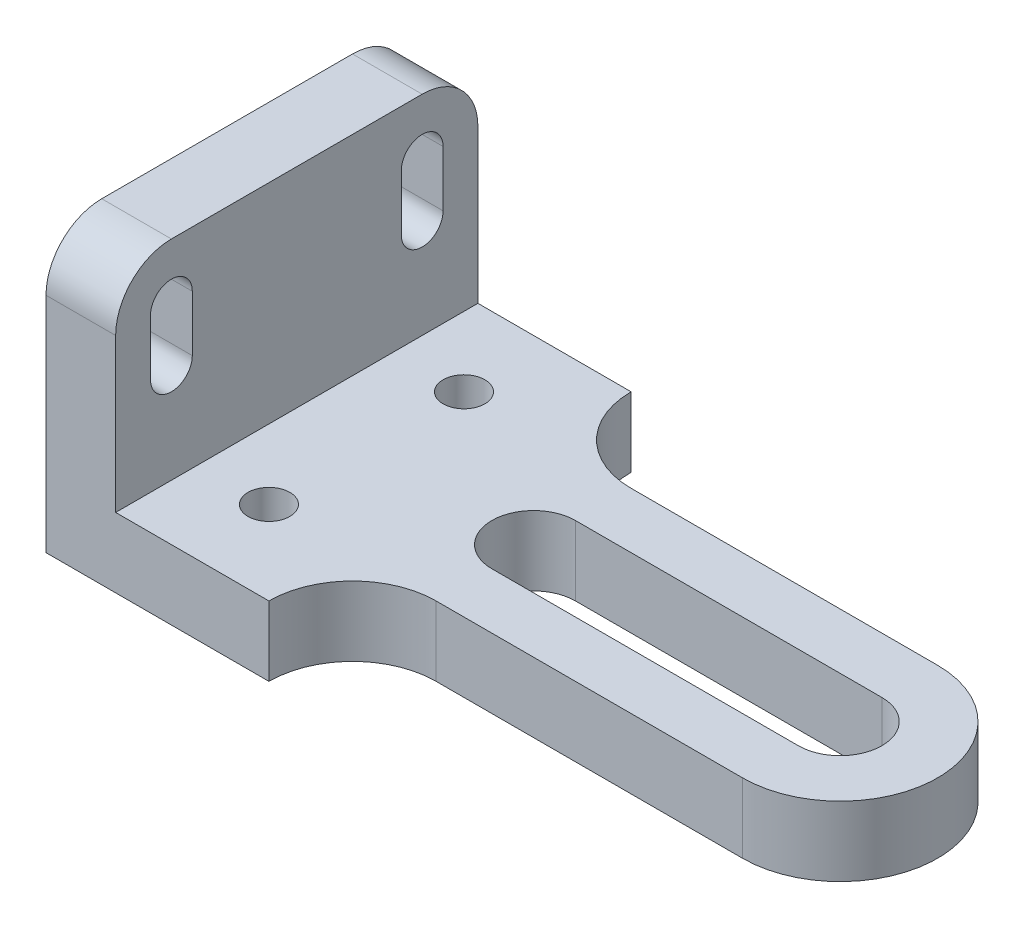
ISO-10303-21;
HEADER;
FILE_DESCRIPTION(('STEP AP214'),'2;1');
FILE_NAME('part.step','',(''),(''),'','','');
FILE_SCHEMA(('AUTOMOTIVE_DESIGN { 1 0 10303 214 1 1 1 1 }'));
ENDSEC;
DATA;
#1=APPLICATION_CONTEXT('core data for automotive mechanical design processes');
#2=APPLICATION_PROTOCOL_DEFINITION('international standard','automotive_design',2000,#1);
#3=PRODUCT_CONTEXT('',#1,'mechanical');
#4=PRODUCT('Part','Part','',(#3));
#5=PRODUCT_RELATED_PRODUCT_CATEGORY('part','',(#4));
#6=PRODUCT_DEFINITION_FORMATION('','',#4);
#7=PRODUCT_DEFINITION_CONTEXT('part definition',#1,'design');
#8=PRODUCT_DEFINITION('design','',#6,#7);
#9=PRODUCT_DEFINITION_SHAPE('','',#8);
#10=(LENGTH_UNIT() NAMED_UNIT(*) SI_UNIT(.MILLI.,.METRE.));
#11=(NAMED_UNIT(*) PLANE_ANGLE_UNIT() SI_UNIT($,.RADIAN.));
#12=(NAMED_UNIT(*) SI_UNIT($,.STERADIAN.) SOLID_ANGLE_UNIT());
#13=UNCERTAINTY_MEASURE_WITH_UNIT(LENGTH_MEASURE(1.E-05),#10,'distance_accuracy_value','');
#14=(GEOMETRIC_REPRESENTATION_CONTEXT(3) GLOBAL_UNCERTAINTY_ASSIGNED_CONTEXT((#13)) GLOBAL_UNIT_ASSIGNED_CONTEXT((#10,
#11,#12)) REPRESENTATION_CONTEXT('',''));
#15=CARTESIAN_POINT('',(0.,0.,0.));
#16=DIRECTION('',(0.,0.,1.));
#17=DIRECTION('',(1.,0.,0.));
#18=AXIS2_PLACEMENT_3D('',#15,#16,#17);
#19=CARTESIAN_POINT('',(10.,32.,-18.));
#20=DIRECTION('',(1.,0.,0.));
#21=DIRECTION('',(0.,0.,-1.));
#22=AXIS2_PLACEMENT_3D('',#19,#20,#21);
#23=PLANE('',#22);
#24=DIRECTION('',(0.,-1.,0.));
#25=VECTOR('',#24,1.);
#26=CARTESIAN_POINT('',(10.,32.,21.));
#27=LINE('',#26,#25);
#28=CARTESIAN_POINT('',(10.,32.,21.));
#29=VERTEX_POINT('',#28);
#30=CARTESIAN_POINT('',(10.,24.,21.));
#31=VERTEX_POINT('',#30);
#32=EDGE_CURVE('E321',#29,#31,#27,.T.);
#33=ORIENTED_EDGE('',*,*,#32,.F.);
#34=CARTESIAN_POINT('',(10.,32.,18.));
#35=DIRECTION('',(1.,0.,0.));
#36=DIRECTION('',(0.,0.,-1.));
#37=AXIS2_PLACEMENT_3D('',#34,#35,#36);
#38=CIRCLE('',#37,2.99999999999999);
#39=CARTESIAN_POINT('',(10.,32.,15.));
#40=VERTEX_POINT('',#39);
#41=EDGE_CURVE('E319',#40,#29,#38,.T.);
#42=ORIENTED_EDGE('',*,*,#41,.F.);
#43=DIRECTION('',(0.,1.,0.));
#44=VECTOR('',#43,1.);
#45=CARTESIAN_POINT('',(10.,32.,15.));
#46=LINE('',#45,#44);
#47=CARTESIAN_POINT('',(10.,24.,15.));
#48=VERTEX_POINT('',#47);
#49=EDGE_CURVE('E327',#48,#40,#46,.T.);
#50=ORIENTED_EDGE('',*,*,#49,.F.);
#51=CARTESIAN_POINT('',(10.,24.,18.));
#52=DIRECTION('',(1.,0.,0.));
#53=DIRECTION('',(0.,0.,-1.));
#54=AXIS2_PLACEMENT_3D('',#51,#52,#53);
#55=CIRCLE('',#54,3.00000000000001);
#56=EDGE_CURVE('E324',#31,#48,#55,.T.);
#57=ORIENTED_EDGE('',*,*,#56,.F.);
#58=EDGE_LOOP('',(#33,#42,#50,#57));
#59=FACE_BOUND('',#58,.T.);
#60=DIRECTION('',(0.,-1.,0.));
#61=VECTOR('',#60,1.);
#62=CARTESIAN_POINT('',(10.,32.,-15.));
#63=LINE('',#62,#61);
#64=CARTESIAN_POINT('',(10.,32.,-15.));
#65=VERTEX_POINT('',#64);
#66=CARTESIAN_POINT('',(10.,24.,-15.));
#67=VERTEX_POINT('',#66);
#68=EDGE_CURVE('E292',#65,#67,#63,.T.);
#69=ORIENTED_EDGE('',*,*,#68,.F.);
#70=CARTESIAN_POINT('',(10.,32.,-18.));
#71=DIRECTION('',(1.,0.,0.));
#72=DIRECTION('',(0.,0.,1.));
#73=AXIS2_PLACEMENT_3D('',#70,#71,#72);
#74=CIRCLE('',#73,2.99999999999999);
#75=CARTESIAN_POINT('',(10.,32.,-21.));
#76=VERTEX_POINT('',#75);
#77=EDGE_CURVE('E290',#76,#65,#74,.T.);
#78=ORIENTED_EDGE('',*,*,#77,.F.);
#79=DIRECTION('',(0.,1.,0.));
#80=VECTOR('',#79,1.);
#81=CARTESIAN_POINT('',(10.,32.,-21.));
#82=LINE('',#81,#80);
#83=CARTESIAN_POINT('',(10.,24.,-21.));
#84=VERTEX_POINT('',#83);
#85=EDGE_CURVE('E297',#84,#76,#82,.T.);
#86=ORIENTED_EDGE('',*,*,#85,.F.);
#87=CARTESIAN_POINT('',(10.,24.,-18.));
#88=DIRECTION('',(1.,0.,0.));
#89=DIRECTION('',(0.,0.,1.));
#90=AXIS2_PLACEMENT_3D('',#87,#88,#89);
#91=CIRCLE('',#90,3.00000000000001);
#92=EDGE_CURVE('E295',#67,#84,#91,.T.);
#93=ORIENTED_EDGE('',*,*,#92,.F.);
#94=EDGE_LOOP('',(#69,#78,#86,#93));
#95=FACE_BOUND('',#94,.T.);
#96=DIRECTION('',(0.,-1.,0.));
#97=VECTOR('',#96,1.);
#98=CARTESIAN_POINT('',(10.,31.9999999999999,26.));
#99=LINE('',#98,#97);
#100=CARTESIAN_POINT('',(10.,31.9999999999999,26.));
#101=VERTEX_POINT('',#100);
#102=CARTESIAN_POINT('',(10.,10.,26.));
#103=VERTEX_POINT('',#102);
#104=EDGE_CURVE('E51',#101,#103,#99,.T.);
#105=ORIENTED_EDGE('',*,*,#104,.T.);
#106=DIRECTION('',(0.,0.,-1.));
#107=VECTOR('',#106,1.);
#108=CARTESIAN_POINT('',(10.,10.,-18.));
#109=LINE('',#108,#107);
#110=CARTESIAN_POINT('',(10.,10.,-26.));
#111=VERTEX_POINT('',#110);
#112=EDGE_CURVE('E287',#103,#111,#109,.T.);
#113=ORIENTED_EDGE('',*,*,#112,.T.);
#114=DIRECTION('',(0.,1.,0.));
#115=VECTOR('',#114,1.);
#116=CARTESIAN_POINT('',(10.,0.,-26.));
#117=LINE('',#116,#115);
#118=CARTESIAN_POINT('',(10.,32.,-26.));
#119=VERTEX_POINT('',#118);
#120=EDGE_CURVE('E351',#111,#119,#117,.T.);
#121=ORIENTED_EDGE('',*,*,#120,.T.);
#122=CARTESIAN_POINT('',(10.,32.,-18.));
#123=DIRECTION('',(1.,0.,0.));
#124=DIRECTION('',(0.,0.,-1.));
#125=AXIS2_PLACEMENT_3D('',#122,#123,#124);
#126=CIRCLE('',#125,8.);
#127=CARTESIAN_POINT('',(10.,40.,-17.9999999999999));
#128=VERTEX_POINT('',#127);
#129=EDGE_CURVE('E354',#119,#128,#126,.T.);
#130=ORIENTED_EDGE('',*,*,#129,.T.);
#131=DIRECTION('',(0.,0.,1.));
#132=VECTOR('',#131,1.);
#133=CARTESIAN_POINT('',(10.,40.,-17.9999999999999));
#134=LINE('',#133,#132);
#135=CARTESIAN_POINT('',(10.,40.,17.9999999999999));
#136=VERTEX_POINT('',#135);
#137=EDGE_CURVE('E356',#128,#136,#134,.T.);
#138=ORIENTED_EDGE('',*,*,#137,.T.);
#139=CARTESIAN_POINT('',(10.,32.,18.));
#140=DIRECTION('',(1.,0.,0.));
#141=DIRECTION('',(0.,0.,-1.));
#142=AXIS2_PLACEMENT_3D('',#139,#140,#141);
#143=CIRCLE('',#142,8.);
#144=EDGE_CURVE('E358',#136,#101,#143,.T.);
#145=ORIENTED_EDGE('',*,*,#144,.T.);
#146=EDGE_LOOP('',(#105,#113,#121,#130,#138,#145));
#147=FACE_BOUND('',#146,.T.);
#148=ADVANCED_FACE('F36',(#59,#95,#147),#23,.T.);
#149=CARTESIAN_POINT('',(0.,32.,-18.));
#150=DIRECTION('',(1.,0.,0.));
#151=DIRECTION('',(0.,0.,-1.));
#152=AXIS2_PLACEMENT_3D('',#149,#150,#151);
#153=PLANE('',#152);
#154=DIRECTION('',(0.,0.,-1.));
#155=VECTOR('',#154,1.);
#156=CARTESIAN_POINT('',(0.,0.,26.));
#157=LINE('',#156,#155);
#158=CARTESIAN_POINT('',(0.,0.,26.));
#159=VERTEX_POINT('',#158);
#160=CARTESIAN_POINT('',(0.,0.,-26.));
#161=VERTEX_POINT('',#160);
#162=EDGE_CURVE('E362',#159,#161,#157,.T.);
#163=ORIENTED_EDGE('',*,*,#162,.F.);
#164=DIRECTION('',(0.,-1.,0.));
#165=VECTOR('',#164,1.);
#166=CARTESIAN_POINT('',(0.,31.9999999999999,26.));
#167=LINE('',#166,#165);
#168=CARTESIAN_POINT('',(0.,31.9999999999999,26.));
#169=VERTEX_POINT('',#168);
#170=EDGE_CURVE('E349',#169,#159,#167,.T.);
#171=ORIENTED_EDGE('',*,*,#170,.F.);
#172=CARTESIAN_POINT('',(0.,32.,18.));
#173=DIRECTION('',(1.,0.,0.));
#174=DIRECTION('',(0.,0.,-1.));
#175=AXIS2_PLACEMENT_3D('',#172,#173,#174);
#176=CIRCLE('',#175,8.);
#177=CARTESIAN_POINT('',(0.,40.,17.9999999999999));
#178=VERTEX_POINT('',#177);
#179=EDGE_CURVE('E352',#178,#169,#176,.T.);
#180=ORIENTED_EDGE('',*,*,#179,.F.);
#181=DIRECTION('',(0.,0.,1.));
#182=VECTOR('',#181,1.);
#183=CARTESIAN_POINT('',(0.,40.,-17.9999999999999));
#184=LINE('',#183,#182);
#185=CARTESIAN_POINT('',(0.,40.,-17.9999999999999));
#186=VERTEX_POINT('',#185);
#187=EDGE_CURVE('E368',#186,#178,#184,.T.);
#188=ORIENTED_EDGE('',*,*,#187,.F.);
#189=CARTESIAN_POINT('',(0.,32.,-18.));
#190=DIRECTION('',(1.,0.,0.));
#191=DIRECTION('',(0.,0.,-1.));
#192=AXIS2_PLACEMENT_3D('',#189,#190,#191);
#193=CIRCLE('',#192,8.);
#194=CARTESIAN_POINT('',(0.,32.,-26.));
#195=VERTEX_POINT('',#194);
#196=EDGE_CURVE('E366',#195,#186,#193,.T.);
#197=ORIENTED_EDGE('',*,*,#196,.F.);
#198=DIRECTION('',(0.,1.,0.));
#199=VECTOR('',#198,1.);
#200=CARTESIAN_POINT('',(0.,0.,-26.));
#201=LINE('',#200,#199);
#202=EDGE_CURVE('E364',#161,#195,#201,.T.);
#203=ORIENTED_EDGE('',*,*,#202,.F.);
#204=EDGE_LOOP('',(#163,#171,#180,#188,#197,#203));
#205=FACE_BOUND('',#204,.T.);
#206=CARTESIAN_POINT('',(0.,32.,-18.));
#207=DIRECTION('',(1.,0.,0.));
#208=DIRECTION('',(0.,0.,1.));
#209=AXIS2_PLACEMENT_3D('',#206,#207,#208);
#210=CIRCLE('',#209,2.99999999999999);
#211=CARTESIAN_POINT('',(0.,32.,-21.));
#212=VERTEX_POINT('',#211);
#213=CARTESIAN_POINT('',(0.,32.,-15.));
#214=VERTEX_POINT('',#213);
#215=EDGE_CURVE('E289',#212,#214,#210,.T.);
#216=ORIENTED_EDGE('',*,*,#215,.T.);
#217=DIRECTION('',(0.,-1.,0.));
#218=VECTOR('',#217,1.);
#219=CARTESIAN_POINT('',(0.,32.,-15.));
#220=LINE('',#219,#218);
#221=CARTESIAN_POINT('',(0.,24.,-15.));
#222=VERTEX_POINT('',#221);
#223=EDGE_CURVE('E302',#214,#222,#220,.T.);
#224=ORIENTED_EDGE('',*,*,#223,.T.);
#225=CARTESIAN_POINT('',(0.,24.,-18.));
#226=DIRECTION('',(1.,0.,0.));
#227=DIRECTION('',(0.,0.,1.));
#228=AXIS2_PLACEMENT_3D('',#225,#226,#227);
#229=CIRCLE('',#228,3.00000000000001);
#230=CARTESIAN_POINT('',(0.,24.,-21.));
#231=VERTEX_POINT('',#230);
#232=EDGE_CURVE('E305',#222,#231,#229,.T.);
#233=ORIENTED_EDGE('',*,*,#232,.T.);
#234=DIRECTION('',(0.,1.,0.));
#235=VECTOR('',#234,1.);
#236=CARTESIAN_POINT('',(0.,32.,-21.));
#237=LINE('',#236,#235);
#238=EDGE_CURVE('E293',#231,#212,#237,.T.);
#239=ORIENTED_EDGE('',*,*,#238,.T.);
#240=EDGE_LOOP('',(#216,#224,#233,#239));
#241=FACE_BOUND('',#240,.T.);
#242=CARTESIAN_POINT('',(0.,32.,18.));
#243=DIRECTION('',(1.,0.,0.));
#244=DIRECTION('',(0.,0.,-1.));
#245=AXIS2_PLACEMENT_3D('',#242,#243,#244);
#246=CIRCLE('',#245,2.99999999999999);
#247=CARTESIAN_POINT('',(0.,32.,15.));
#248=VERTEX_POINT('',#247);
#249=CARTESIAN_POINT('',(0.,32.,21.));
#250=VERTEX_POINT('',#249);
#251=EDGE_CURVE('E318',#248,#250,#246,.T.);
#252=ORIENTED_EDGE('',*,*,#251,.T.);
#253=DIRECTION('',(0.,-1.,0.));
#254=VECTOR('',#253,1.);
#255=CARTESIAN_POINT('',(0.,32.,21.));
#256=LINE('',#255,#254);
#257=CARTESIAN_POINT('',(0.,24.,21.));
#258=VERTEX_POINT('',#257);
#259=EDGE_CURVE('E332',#250,#258,#256,.T.);
#260=ORIENTED_EDGE('',*,*,#259,.T.);
#261=CARTESIAN_POINT('',(0.,24.,18.));
#262=DIRECTION('',(1.,0.,0.));
#263=DIRECTION('',(0.,0.,-1.));
#264=AXIS2_PLACEMENT_3D('',#261,#262,#263);
#265=CIRCLE('',#264,3.00000000000001);
#266=CARTESIAN_POINT('',(0.,24.,15.));
#267=VERTEX_POINT('',#266);
#268=EDGE_CURVE('E335',#258,#267,#265,.T.);
#269=ORIENTED_EDGE('',*,*,#268,.T.);
#270=DIRECTION('',(0.,1.,0.));
#271=VECTOR('',#270,1.);
#272=CARTESIAN_POINT('',(0.,32.,15.));
#273=LINE('',#272,#271);
#274=EDGE_CURVE('E322',#267,#248,#273,.T.);
#275=ORIENTED_EDGE('',*,*,#274,.T.);
#276=EDGE_LOOP('',(#252,#260,#269,#275));
#277=FACE_BOUND('',#276,.T.);
#278=ADVANCED_FACE('F393',(#205,#241,#277),#153,.F.);
#279=CARTESIAN_POINT('',(10.,31.9999999999999,26.));
#280=DIRECTION('',(0.,0.,-1.));
#281=DIRECTION('',(0.,1.,0.));
#282=AXIS2_PLACEMENT_3D('',#279,#280,#281);
#283=PLANE('',#282);
#284=DIRECTION('',(-1.,0.,0.));
#285=VECTOR('',#284,1.);
#286=CARTESIAN_POINT('',(10.,0.,26.));
#287=LINE('',#286,#285);
#288=CARTESIAN_POINT('',(32.,0.,26.));
#289=VERTEX_POINT('',#288);
#290=EDGE_CURVE('E11',#289,#159,#287,.T.);
#291=ORIENTED_EDGE('',*,*,#290,.F.);
#292=DIRECTION('',(0.,-1.,0.));
#293=VECTOR('',#292,1.);
#294=CARTESIAN_POINT('',(32.,10.,26.));
#295=LINE('',#294,#293);
#296=CARTESIAN_POINT('',(32.,10.,26.));
#297=VERTEX_POINT('',#296);
#298=EDGE_CURVE('E284',#297,#289,#295,.T.);
#299=ORIENTED_EDGE('',*,*,#298,.F.);
#300=DIRECTION('',(1.,0.,0.));
#301=VECTOR('',#300,1.);
#302=CARTESIAN_POINT('',(0.,10.,26.));
#303=LINE('',#302,#301);
#304=EDGE_CURVE('E244',#103,#297,#303,.T.);
#305=ORIENTED_EDGE('',*,*,#304,.F.);
#306=ORIENTED_EDGE('',*,*,#104,.F.);
#307=DIRECTION('',(-1.,0.,0.));
#308=VECTOR('',#307,1.);
#309=CARTESIAN_POINT('',(10.,31.9999999999999,26.));
#310=LINE('',#309,#308);
#311=EDGE_CURVE('E360',#101,#169,#310,.T.);
#312=ORIENTED_EDGE('',*,*,#311,.T.);
#313=ORIENTED_EDGE('',*,*,#170,.T.);
#314=EDGE_LOOP('',(#291,#299,#305,#306,#312,#313));
#315=FACE_BOUND('',#314,.T.);
#316=ADVANCED_FACE('F38',(#315),#283,.F.);
#317=CARTESIAN_POINT('',(10.,0.,26.));
#318=DIRECTION('',(0.,1.,0.));
#319=DIRECTION('',(0.,0.,1.));
#320=AXIS2_PLACEMENT_3D('',#317,#318,#319);
#321=PLANE('',#320);
#322=ORIENTED_EDGE('',*,*,#162,.T.);
#323=DIRECTION('',(-1.,0.,0.));
#324=VECTOR('',#323,1.);
#325=CARTESIAN_POINT('',(10.,0.,-26.));
#326=LINE('',#325,#324);
#327=CARTESIAN_POINT('',(32.,0.,-26.));
#328=VERTEX_POINT('',#327);
#329=EDGE_CURVE('E44',#328,#161,#326,.T.);
#330=ORIENTED_EDGE('',*,*,#329,.F.);
#331=CARTESIAN_POINT('',(44.,0.,-26.));
#332=DIRECTION('',(0.,-1.,0.));
#333=DIRECTION('',(0.,0.,1.));
#334=AXIS2_PLACEMENT_3D('',#331,#332,#333);
#335=CIRCLE('',#334,12.);
#336=CARTESIAN_POINT('',(44.,0.,-14.));
#337=VERTEX_POINT('',#336);
#338=EDGE_CURVE('E247',#337,#328,#335,.T.);
#339=ORIENTED_EDGE('',*,*,#338,.F.);
#340=DIRECTION('',(-1.,0.,0.));
#341=VECTOR('',#340,1.);
#342=CARTESIAN_POINT('',(44.,0.,-14.));
#343=LINE('',#342,#341);
#344=CARTESIAN_POINT('',(88.,0.,-14.));
#345=VERTEX_POINT('',#344);
#346=EDGE_CURVE('E266',#345,#337,#343,.T.);
#347=ORIENTED_EDGE('',*,*,#346,.F.);
#348=CARTESIAN_POINT('',(88.,0.,0.));
#349=DIRECTION('',(0.,1.,0.));
#350=DIRECTION('',(0.,0.,-1.));
#351=AXIS2_PLACEMENT_3D('',#348,#349,#350);
#352=CIRCLE('',#351,14.);
#353=CARTESIAN_POINT('',(87.9999999999999,0.,14.));
#354=VERTEX_POINT('',#353);
#355=EDGE_CURVE('E264',#354,#345,#352,.T.);
#356=ORIENTED_EDGE('',*,*,#355,.F.);
#357=DIRECTION('',(1.,0.,0.));
#358=VECTOR('',#357,1.);
#359=CARTESIAN_POINT('',(44.,0.,14.));
#360=LINE('',#359,#358);
#361=CARTESIAN_POINT('',(44.,0.,14.));
#362=VERTEX_POINT('',#361);
#363=EDGE_CURVE('E262',#362,#354,#360,.T.);
#364=ORIENTED_EDGE('',*,*,#363,.F.);
#365=CARTESIAN_POINT('',(44.,0.,26.));
#366=DIRECTION('',(0.,-1.,0.));
#367=DIRECTION('',(0.,0.,-1.));
#368=AXIS2_PLACEMENT_3D('',#365,#366,#367);
#369=CIRCLE('',#368,12.);
#370=EDGE_CURVE('E217',#289,#362,#369,.T.);
#371=ORIENTED_EDGE('',*,*,#370,.F.);
#372=ORIENTED_EDGE('',*,*,#290,.T.);
#373=EDGE_LOOP('',(#322,#330,#339,#347,#356,#364,#371,#372));
#374=FACE_BOUND('',#373,.T.);
#375=CARTESIAN_POINT('',(20.,0.,14.));
#376=DIRECTION('',(0.,1.,0.));
#377=DIRECTION('',(0.,0.,1.));
#378=AXIS2_PLACEMENT_3D('',#375,#376,#377);
#379=CIRCLE('',#378,3.);
#380=CARTESIAN_POINT('',(20.,0.,17.));
#381=VERTEX_POINT('',#380);
#382=EDGE_CURVE('E528',#381,#381,#379,.T.);
#383=ORIENTED_EDGE('',*,*,#382,.T.);
#384=EDGE_LOOP('',(#383));
#385=FACE_BOUND('',#384,.T.);
#386=DIRECTION('',(-1.,0.,0.));
#387=VECTOR('',#386,1.);
#388=CARTESIAN_POINT('',(44.,0.,-6.));
#389=LINE('',#388,#387);
#390=CARTESIAN_POINT('',(88.,0.,-6.));
#391=VERTEX_POINT('',#390);
#392=CARTESIAN_POINT('',(44.,0.,-6.));
#393=VERTEX_POINT('',#392);
#394=EDGE_CURVE('E210',#391,#393,#389,.T.);
#395=ORIENTED_EDGE('',*,*,#394,.T.);
#396=CARTESIAN_POINT('',(44.,0.,0.));
#397=DIRECTION('',(0.,1.,0.));
#398=DIRECTION('',(0.,0.,1.));
#399=AXIS2_PLACEMENT_3D('',#396,#397,#398);
#400=CIRCLE('',#399,6.);
#401=CARTESIAN_POINT('',(44.,0.,6.));
#402=VERTEX_POINT('',#401);
#403=EDGE_CURVE('E231',#393,#402,#400,.T.);
#404=ORIENTED_EDGE('',*,*,#403,.T.);
#405=DIRECTION('',(1.,0.,0.));
#406=VECTOR('',#405,1.);
#407=CARTESIAN_POINT('',(44.,0.,6.));
#408=LINE('',#407,#406);
#409=CARTESIAN_POINT('',(88.,0.,6.));
#410=VERTEX_POINT('',#409);
#411=EDGE_CURVE('E216',#402,#410,#408,.T.);
#412=ORIENTED_EDGE('',*,*,#411,.T.);
#413=CARTESIAN_POINT('',(88.,0.,0.));
#414=DIRECTION('',(0.,1.,0.));
#415=DIRECTION('',(0.,0.,1.));
#416=AXIS2_PLACEMENT_3D('',#413,#414,#415);
#417=CIRCLE('',#416,6.);
#418=EDGE_CURVE('E235',#410,#391,#417,.T.);
#419=ORIENTED_EDGE('',*,*,#418,.T.);
#420=EDGE_LOOP('',(#395,#404,#412,#419));
#421=FACE_BOUND('',#420,.T.);
#422=CARTESIAN_POINT('',(20.,0.,-14.));
#423=DIRECTION('',(0.,1.,0.));
#424=DIRECTION('',(0.,0.,1.));
#425=AXIS2_PLACEMENT_3D('',#422,#423,#424);
#426=CIRCLE('',#425,3.);
#427=CARTESIAN_POINT('',(20.,0.,-11.));
#428=VERTEX_POINT('',#427);
#429=EDGE_CURVE('E525',#428,#428,#426,.T.);
#430=ORIENTED_EDGE('',*,*,#429,.T.);
#431=EDGE_LOOP('',(#430));
#432=FACE_BOUND('',#431,.T.);
#433=ADVANCED_FACE('F416',(#374,#385,#421,#432),#321,.F.);
#434=CARTESIAN_POINT('',(10.,0.,-26.));
#435=DIRECTION('',(0.,0.,1.));
#436=DIRECTION('',(0.,-1.,0.));
#437=AXIS2_PLACEMENT_3D('',#434,#435,#436);
#438=PLANE('',#437);
#439=ORIENTED_EDGE('',*,*,#202,.T.);
#440=DIRECTION('',(-1.,0.,0.));
#441=VECTOR('',#440,1.);
#442=CARTESIAN_POINT('',(10.,32.,-26.));
#443=LINE('',#442,#441);
#444=EDGE_CURVE('E379',#119,#195,#443,.T.);
#445=ORIENTED_EDGE('',*,*,#444,.F.);
#446=ORIENTED_EDGE('',*,*,#120,.F.);
#447=DIRECTION('',(-1.,0.,0.));
#448=VECTOR('',#447,1.);
#449=CARTESIAN_POINT('',(0.,10.,-26.));
#450=LINE('',#449,#448);
#451=CARTESIAN_POINT('',(32.,10.,-26.));
#452=VERTEX_POINT('',#451);
#453=EDGE_CURVE('E257',#452,#111,#450,.T.);
#454=ORIENTED_EDGE('',*,*,#453,.F.);
#455=DIRECTION('',(0.,-1.,0.));
#456=VECTOR('',#455,1.);
#457=CARTESIAN_POINT('',(32.,10.,-26.));
#458=LINE('',#457,#456);
#459=EDGE_CURVE('E260',#452,#328,#458,.T.);
#460=ORIENTED_EDGE('',*,*,#459,.T.);
#461=ORIENTED_EDGE('',*,*,#329,.T.);
#462=EDGE_LOOP('',(#439,#445,#446,#454,#460,#461));
#463=FACE_BOUND('',#462,.T.);
#464=ADVANCED_FACE('F384',(#463),#438,.F.);
#465=CARTESIAN_POINT('',(10.,32.,-18.));
#466=DIRECTION('',(-1.,0.,0.));
#467=DIRECTION('',(0.,0.,1.));
#468=AXIS2_PLACEMENT_3D('',#465,#466,#467);
#469=CYLINDRICAL_SURFACE('',#468,8.);
#470=ORIENTED_EDGE('',*,*,#196,.T.);
#471=DIRECTION('',(-1.,0.,0.));
#472=VECTOR('',#471,1.);
#473=CARTESIAN_POINT('',(10.,40.,-17.9999999999999));
#474=LINE('',#473,#472);
#475=EDGE_CURVE('E376',#128,#186,#474,.T.);
#476=ORIENTED_EDGE('',*,*,#475,.F.);
#477=ORIENTED_EDGE('',*,*,#129,.F.);
#478=ORIENTED_EDGE('',*,*,#444,.T.);
#479=EDGE_LOOP('',(#470,#476,#477,#478));
#480=FACE_BOUND('',#479,.T.);
#481=ADVANCED_FACE('F400',(#480),#469,.T.);
#482=CARTESIAN_POINT('',(10.,40.,-17.9999999999999));
#483=DIRECTION('',(0.,-1.,0.));
#484=DIRECTION('',(0.,0.,-1.));
#485=AXIS2_PLACEMENT_3D('',#482,#483,#484);
#486=PLANE('',#485);
#487=ORIENTED_EDGE('',*,*,#187,.T.);
#488=DIRECTION('',(-1.,0.,0.));
#489=VECTOR('',#488,1.);
#490=CARTESIAN_POINT('',(10.,40.,17.9999999999999));
#491=LINE('',#490,#489);
#492=EDGE_CURVE('E373',#136,#178,#491,.T.);
#493=ORIENTED_EDGE('',*,*,#492,.F.);
#494=ORIENTED_EDGE('',*,*,#137,.F.);
#495=ORIENTED_EDGE('',*,*,#475,.T.);
#496=EDGE_LOOP('',(#487,#493,#494,#495));
#497=FACE_BOUND('',#496,.T.);
#498=ADVANCED_FACE('F404',(#497),#486,.F.);
#499=CARTESIAN_POINT('',(10.,32.,18.));
#500=DIRECTION('',(-1.,0.,0.));
#501=DIRECTION('',(0.,0.,1.));
#502=AXIS2_PLACEMENT_3D('',#499,#500,#501);
#503=CYLINDRICAL_SURFACE('',#502,8.);
#504=ORIENTED_EDGE('',*,*,#179,.T.);
#505=ORIENTED_EDGE('',*,*,#311,.F.);
#506=ORIENTED_EDGE('',*,*,#144,.F.);
#507=ORIENTED_EDGE('',*,*,#492,.T.);
#508=EDGE_LOOP('',(#504,#505,#506,#507));
#509=FACE_BOUND('',#508,.T.);
#510=ADVANCED_FACE('F438',(#509),#503,.T.);
#511=CARTESIAN_POINT('',(10.,32.,18.));
#512=DIRECTION('',(-1.,0.,0.));
#513=DIRECTION('',(0.,0.,1.));
#514=AXIS2_PLACEMENT_3D('',#511,#512,#513);
#515=CYLINDRICAL_SURFACE('',#514,2.99999999999999);
#516=ORIENTED_EDGE('',*,*,#251,.F.);
#517=DIRECTION('',(-1.,0.,0.));
#518=VECTOR('',#517,1.);
#519=CARTESIAN_POINT('',(10.,32.,15.));
#520=LINE('',#519,#518);
#521=EDGE_CURVE('E329',#40,#248,#520,.T.);
#522=ORIENTED_EDGE('',*,*,#521,.F.);
#523=ORIENTED_EDGE('',*,*,#41,.T.);
#524=DIRECTION('',(-1.,0.,0.));
#525=VECTOR('',#524,1.);
#526=CARTESIAN_POINT('',(10.,32.,21.));
#527=LINE('',#526,#525);
#528=EDGE_CURVE('E346',#29,#250,#527,.T.);
#529=ORIENTED_EDGE('',*,*,#528,.T.);
#530=EDGE_LOOP('',(#516,#522,#523,#529));
#531=FACE_BOUND('',#530,.T.);
#532=ADVANCED_FACE('F440',(#531),#515,.F.);
#533=CARTESIAN_POINT('',(10.,32.,21.));
#534=DIRECTION('',(0.,0.,-1.));
#535=DIRECTION('',(0.,1.,0.));
#536=AXIS2_PLACEMENT_3D('',#533,#534,#535);
#537=PLANE('',#536);
#538=ORIENTED_EDGE('',*,*,#259,.F.);
#539=ORIENTED_EDGE('',*,*,#528,.F.);
#540=ORIENTED_EDGE('',*,*,#32,.T.);
#541=DIRECTION('',(-1.,0.,0.));
#542=VECTOR('',#541,1.);
#543=CARTESIAN_POINT('',(10.,24.,21.));
#544=LINE('',#543,#542);
#545=EDGE_CURVE('E344',#31,#258,#544,.T.);
#546=ORIENTED_EDGE('',*,*,#545,.T.);
#547=EDGE_LOOP('',(#538,#539,#540,#546));
#548=FACE_BOUND('',#547,.T.);
#549=ADVANCED_FACE('F446',(#548),#537,.T.);
#550=CARTESIAN_POINT('',(10.,24.,18.));
#551=DIRECTION('',(-1.,0.,0.));
#552=DIRECTION('',(0.,0.,1.));
#553=AXIS2_PLACEMENT_3D('',#550,#551,#552);
#554=CYLINDRICAL_SURFACE('',#553,3.00000000000001);
#555=ORIENTED_EDGE('',*,*,#268,.F.);
#556=ORIENTED_EDGE('',*,*,#545,.F.);
#557=ORIENTED_EDGE('',*,*,#56,.T.);
#558=DIRECTION('',(-1.,0.,0.));
#559=VECTOR('',#558,1.);
#560=CARTESIAN_POINT('',(10.,24.,15.));
#561=LINE('',#560,#559);
#562=EDGE_CURVE('E342',#48,#267,#561,.T.);
#563=ORIENTED_EDGE('',*,*,#562,.T.);
#564=EDGE_LOOP('',(#555,#556,#557,#563));
#565=FACE_BOUND('',#564,.T.);
#566=ADVANCED_FACE('F462',(#565),#554,.F.);
#567=CARTESIAN_POINT('',(10.,32.,15.));
#568=DIRECTION('',(0.,0.,1.));
#569=DIRECTION('',(0.,-1.,0.));
#570=AXIS2_PLACEMENT_3D('',#567,#568,#569);
#571=PLANE('',#570);
#572=ORIENTED_EDGE('',*,*,#274,.F.);
#573=ORIENTED_EDGE('',*,*,#562,.F.);
#574=ORIENTED_EDGE('',*,*,#49,.T.);
#575=ORIENTED_EDGE('',*,*,#521,.T.);
#576=EDGE_LOOP('',(#572,#573,#574,#575));
#577=FACE_BOUND('',#576,.T.);
#578=ADVANCED_FACE('F466',(#577),#571,.T.);
#579=CARTESIAN_POINT('',(10.,32.,-18.));
#580=DIRECTION('',(-1.,0.,0.));
#581=DIRECTION('',(0.,0.,1.));
#582=AXIS2_PLACEMENT_3D('',#579,#580,#581);
#583=CYLINDRICAL_SURFACE('',#582,2.99999999999999);
#584=ORIENTED_EDGE('',*,*,#215,.F.);
#585=DIRECTION('',(-1.,0.,0.));
#586=VECTOR('',#585,1.);
#587=CARTESIAN_POINT('',(10.,32.,-21.));
#588=LINE('',#587,#586);
#589=EDGE_CURVE('E299',#76,#212,#588,.T.);
#590=ORIENTED_EDGE('',*,*,#589,.F.);
#591=ORIENTED_EDGE('',*,*,#77,.T.);
#592=DIRECTION('',(-1.,0.,0.));
#593=VECTOR('',#592,1.);
#594=CARTESIAN_POINT('',(10.,32.,-15.));
#595=LINE('',#594,#593);
#596=EDGE_CURVE('E315',#65,#214,#595,.T.);
#597=ORIENTED_EDGE('',*,*,#596,.T.);
#598=EDGE_LOOP('',(#584,#590,#591,#597));
#599=FACE_BOUND('',#598,.T.);
#600=ADVANCED_FACE('F470',(#599),#583,.F.);
#601=CARTESIAN_POINT('',(10.,32.,-15.));
#602=DIRECTION('',(0.,0.,-1.));
#603=DIRECTION('',(0.,1.,0.));
#604=AXIS2_PLACEMENT_3D('',#601,#602,#603);
#605=PLANE('',#604);
#606=ORIENTED_EDGE('',*,*,#223,.F.);
#607=ORIENTED_EDGE('',*,*,#596,.F.);
#608=ORIENTED_EDGE('',*,*,#68,.T.);
#609=DIRECTION('',(-1.,0.,0.));
#610=VECTOR('',#609,1.);
#611=CARTESIAN_POINT('',(10.,24.,-15.));
#612=LINE('',#611,#610);
#613=EDGE_CURVE('E313',#67,#222,#612,.T.);
#614=ORIENTED_EDGE('',*,*,#613,.T.);
#615=EDGE_LOOP('',(#606,#607,#608,#614));
#616=FACE_BOUND('',#615,.T.);
#617=ADVANCED_FACE('F474',(#616),#605,.T.);
#618=CARTESIAN_POINT('',(10.,24.,-18.));
#619=DIRECTION('',(-1.,0.,0.));
#620=DIRECTION('',(0.,0.,1.));
#621=AXIS2_PLACEMENT_3D('',#618,#619,#620);
#622=CYLINDRICAL_SURFACE('',#621,3.00000000000001);
#623=ORIENTED_EDGE('',*,*,#232,.F.);
#624=ORIENTED_EDGE('',*,*,#613,.F.);
#625=ORIENTED_EDGE('',*,*,#92,.T.);
#626=DIRECTION('',(-1.,0.,0.));
#627=VECTOR('',#626,1.);
#628=CARTESIAN_POINT('',(10.,24.,-21.));
#629=LINE('',#628,#627);
#630=EDGE_CURVE('E59',#84,#231,#629,.T.);
#631=ORIENTED_EDGE('',*,*,#630,.T.);
#632=EDGE_LOOP('',(#623,#624,#625,#631));
#633=FACE_BOUND('',#632,.T.);
#634=ADVANCED_FACE('F478',(#633),#622,.F.);
#635=CARTESIAN_POINT('',(10.,32.,-21.));
#636=DIRECTION('',(0.,0.,1.));
#637=DIRECTION('',(0.,-1.,0.));
#638=AXIS2_PLACEMENT_3D('',#635,#636,#637);
#639=PLANE('',#638);
#640=ORIENTED_EDGE('',*,*,#238,.F.);
#641=ORIENTED_EDGE('',*,*,#630,.F.);
#642=ORIENTED_EDGE('',*,*,#85,.T.);
#643=ORIENTED_EDGE('',*,*,#589,.T.);
#644=EDGE_LOOP('',(#640,#641,#642,#643));
#645=FACE_BOUND('',#644,.T.);
#646=ADVANCED_FACE('F482',(#645),#639,.T.);
#647=CARTESIAN_POINT('',(44.,10.,26.));
#648=DIRECTION('',(0.,-1.,0.));
#649=DIRECTION('',(0.,0.,-1.));
#650=AXIS2_PLACEMENT_3D('',#647,#648,#649);
#651=PLANE('',#650);
#652=ORIENTED_EDGE('',*,*,#112,.F.);
#653=ORIENTED_EDGE('',*,*,#304,.T.);
#654=CARTESIAN_POINT('',(44.,10.,26.));
#655=DIRECTION('',(0.,-1.,0.));
#656=DIRECTION('',(0.,0.,-1.));
#657=AXIS2_PLACEMENT_3D('',#654,#655,#656);
#658=CIRCLE('',#657,12.);
#659=CARTESIAN_POINT('',(44.,10.,14.));
#660=VERTEX_POINT('',#659);
#661=EDGE_CURVE('E246',#297,#660,#658,.T.);
#662=ORIENTED_EDGE('',*,*,#661,.T.);
#663=DIRECTION('',(1.,0.,0.));
#664=VECTOR('',#663,1.);
#665=CARTESIAN_POINT('',(44.,10.,14.));
#666=LINE('',#665,#664);
#667=CARTESIAN_POINT('',(87.9999999999999,10.,14.));
#668=VERTEX_POINT('',#667);
#669=EDGE_CURVE('E249',#660,#668,#666,.T.);
#670=ORIENTED_EDGE('',*,*,#669,.T.);
#671=CARTESIAN_POINT('',(88.,10.,0.));
#672=DIRECTION('',(0.,1.,0.));
#673=DIRECTION('',(0.,0.,-1.));
#674=AXIS2_PLACEMENT_3D('',#671,#672,#673);
#675=CIRCLE('',#674,14.);
#676=CARTESIAN_POINT('',(88.,10.,-14.));
#677=VERTEX_POINT('',#676);
#678=EDGE_CURVE('E251',#668,#677,#675,.T.);
#679=ORIENTED_EDGE('',*,*,#678,.T.);
#680=DIRECTION('',(-1.,0.,0.));
#681=VECTOR('',#680,1.);
#682=CARTESIAN_POINT('',(44.,10.,-14.));
#683=LINE('',#682,#681);
#684=CARTESIAN_POINT('',(44.,10.,-14.));
#685=VERTEX_POINT('',#684);
#686=EDGE_CURVE('E253',#677,#685,#683,.T.);
#687=ORIENTED_EDGE('',*,*,#686,.T.);
#688=CARTESIAN_POINT('',(44.,10.,-26.));
#689=DIRECTION('',(0.,-1.,0.));
#690=DIRECTION('',(0.,0.,1.));
#691=AXIS2_PLACEMENT_3D('',#688,#689,#690);
#692=CIRCLE('',#691,12.);
#693=EDGE_CURVE('E255',#685,#452,#692,.T.);
#694=ORIENTED_EDGE('',*,*,#693,.T.);
#695=ORIENTED_EDGE('',*,*,#453,.T.);
#696=EDGE_LOOP('',(#652,#653,#662,#670,#679,#687,#694,#695));
#697=FACE_BOUND('',#696,.T.);
#698=CARTESIAN_POINT('',(44.,10.,0.));
#699=DIRECTION('',(0.,1.,0.));
#700=DIRECTION('',(0.,0.,1.));
#701=AXIS2_PLACEMENT_3D('',#698,#699,#700);
#702=CIRCLE('',#701,6.);
#703=CARTESIAN_POINT('',(44.,10.,-6.));
#704=VERTEX_POINT('',#703);
#705=CARTESIAN_POINT('',(44.,10.,6.));
#706=VERTEX_POINT('',#705);
#707=EDGE_CURVE('E199',#704,#706,#702,.T.);
#708=ORIENTED_EDGE('',*,*,#707,.F.);
#709=DIRECTION('',(-1.,0.,0.));
#710=VECTOR('',#709,1.);
#711=CARTESIAN_POINT('',(44.,10.,-6.));
#712=LINE('',#711,#710);
#713=CARTESIAN_POINT('',(88.,10.,-6.));
#714=VERTEX_POINT('',#713);
#715=EDGE_CURVE('E226',#714,#704,#712,.T.);
#716=ORIENTED_EDGE('',*,*,#715,.F.);
#717=CARTESIAN_POINT('',(88.,10.,0.));
#718=DIRECTION('',(0.,1.,0.));
#719=DIRECTION('',(0.,0.,1.));
#720=AXIS2_PLACEMENT_3D('',#717,#718,#719);
#721=CIRCLE('',#720,6.);
#722=CARTESIAN_POINT('',(88.,10.,6.));
#723=VERTEX_POINT('',#722);
#724=EDGE_CURVE('E224',#723,#714,#721,.T.);
#725=ORIENTED_EDGE('',*,*,#724,.F.);
#726=DIRECTION('',(1.,0.,0.));
#727=VECTOR('',#726,1.);
#728=CARTESIAN_POINT('',(44.,10.,6.));
#729=LINE('',#728,#727);
#730=EDGE_CURVE('E209',#706,#723,#729,.T.);
#731=ORIENTED_EDGE('',*,*,#730,.F.);
#732=EDGE_LOOP('',(#708,#716,#725,#731));
#733=FACE_BOUND('',#732,.T.);
#734=CARTESIAN_POINT('',(20.,10.,14.));
#735=DIRECTION('',(0.,1.,0.));
#736=DIRECTION('',(0.,0.,1.));
#737=AXIS2_PLACEMENT_3D('',#734,#735,#736);
#738=CIRCLE('',#737,3.);
#739=CARTESIAN_POINT('',(20.,10.,17.));
#740=VERTEX_POINT('',#739);
#741=EDGE_CURVE('E233',#740,#740,#738,.T.);
#742=ORIENTED_EDGE('',*,*,#741,.F.);
#743=EDGE_LOOP('',(#742));
#744=FACE_BOUND('',#743,.T.);
#745=CARTESIAN_POINT('',(20.,10.,-14.));
#746=DIRECTION('',(0.,1.,0.));
#747=DIRECTION('',(0.,0.,1.));
#748=AXIS2_PLACEMENT_3D('',#745,#746,#747);
#749=CIRCLE('',#748,3.);
#750=CARTESIAN_POINT('',(20.,10.,-11.));
#751=VERTEX_POINT('',#750);
#752=EDGE_CURVE('E522',#751,#751,#749,.T.);
#753=ORIENTED_EDGE('',*,*,#752,.F.);
#754=EDGE_LOOP('',(#753));
#755=FACE_BOUND('',#754,.T.);
#756=ADVANCED_FACE('F221',(#697,#733,#744,#755),#651,.F.);
#757=CARTESIAN_POINT('',(44.,10.,26.));
#758=DIRECTION('',(0.,-1.,0.));
#759=DIRECTION('',(0.,0.,-1.));
#760=AXIS2_PLACEMENT_3D('',#757,#758,#759);
#761=CYLINDRICAL_SURFACE('',#760,12.);
#762=ORIENTED_EDGE('',*,*,#370,.T.);
#763=DIRECTION('',(0.,-1.,0.));
#764=VECTOR('',#763,1.);
#765=CARTESIAN_POINT('',(44.,10.,14.));
#766=LINE('',#765,#764);
#767=EDGE_CURVE('E281',#660,#362,#766,.T.);
#768=ORIENTED_EDGE('',*,*,#767,.F.);
#769=ORIENTED_EDGE('',*,*,#661,.F.);
#770=ORIENTED_EDGE('',*,*,#298,.T.);
#771=EDGE_LOOP('',(#762,#768,#769,#770));
#772=FACE_BOUND('',#771,.T.);
#773=ADVANCED_FACE('F433',(#772),#761,.F.);
#774=CARTESIAN_POINT('',(44.,10.,14.));
#775=DIRECTION('',(0.,0.,-1.));
#776=DIRECTION('',(-1.,0.,0.));
#777=AXIS2_PLACEMENT_3D('',#774,#775,#776);
#778=PLANE('',#777);
#779=ORIENTED_EDGE('',*,*,#363,.T.);
#780=DIRECTION('',(0.,-1.,0.));
#781=VECTOR('',#780,1.);
#782=CARTESIAN_POINT('',(87.9999999999999,10.,14.));
#783=LINE('',#782,#781);
#784=EDGE_CURVE('E278',#668,#354,#783,.T.);
#785=ORIENTED_EDGE('',*,*,#784,.F.);
#786=ORIENTED_EDGE('',*,*,#669,.F.);
#787=ORIENTED_EDGE('',*,*,#767,.T.);
#788=EDGE_LOOP('',(#779,#785,#786,#787));
#789=FACE_BOUND('',#788,.T.);
#790=ADVANCED_FACE('F429',(#789),#778,.F.);
#791=CARTESIAN_POINT('',(88.,10.,0.));
#792=DIRECTION('',(0.,-1.,0.));
#793=DIRECTION('',(0.,0.,-1.));
#794=AXIS2_PLACEMENT_3D('',#791,#792,#793);
#795=CYLINDRICAL_SURFACE('',#794,14.);
#796=ORIENTED_EDGE('',*,*,#355,.T.);
#797=DIRECTION('',(0.,-1.,0.));
#798=VECTOR('',#797,1.);
#799=CARTESIAN_POINT('',(88.,10.,-14.));
#800=LINE('',#799,#798);
#801=EDGE_CURVE('E275',#677,#345,#800,.T.);
#802=ORIENTED_EDGE('',*,*,#801,.F.);
#803=ORIENTED_EDGE('',*,*,#678,.F.);
#804=ORIENTED_EDGE('',*,*,#784,.T.);
#805=EDGE_LOOP('',(#796,#802,#803,#804));
#806=FACE_BOUND('',#805,.T.);
#807=ADVANCED_FACE('F425',(#806),#795,.T.);
#808=CARTESIAN_POINT('',(44.,10.,-14.));
#809=DIRECTION('',(0.,0.,1.));
#810=DIRECTION('',(1.,0.,0.));
#811=AXIS2_PLACEMENT_3D('',#808,#809,#810);
#812=PLANE('',#811);
#813=ORIENTED_EDGE('',*,*,#346,.T.);
#814=DIRECTION('',(0.,-1.,0.));
#815=VECTOR('',#814,1.);
#816=CARTESIAN_POINT('',(44.,10.,-14.));
#817=LINE('',#816,#815);
#818=EDGE_CURVE('E272',#685,#337,#817,.T.);
#819=ORIENTED_EDGE('',*,*,#818,.F.);
#820=ORIENTED_EDGE('',*,*,#686,.F.);
#821=ORIENTED_EDGE('',*,*,#801,.T.);
#822=EDGE_LOOP('',(#813,#819,#820,#821));
#823=FACE_BOUND('',#822,.T.);
#824=ADVANCED_FACE('F421',(#823),#812,.F.);
#825=CARTESIAN_POINT('',(44.,10.,-26.));
#826=DIRECTION('',(0.,-1.,0.));
#827=DIRECTION('',(0.,0.,-1.));
#828=AXIS2_PLACEMENT_3D('',#825,#826,#827);
#829=CYLINDRICAL_SURFACE('',#828,12.);
#830=ORIENTED_EDGE('',*,*,#338,.T.);
#831=ORIENTED_EDGE('',*,*,#459,.F.);
#832=ORIENTED_EDGE('',*,*,#693,.F.);
#833=ORIENTED_EDGE('',*,*,#818,.T.);
#834=EDGE_LOOP('',(#830,#831,#832,#833));
#835=FACE_BOUND('',#834,.T.);
#836=ADVANCED_FACE('F414',(#835),#829,.F.);
#837=CARTESIAN_POINT('',(44.,10.,0.));
#838=DIRECTION('',(0.,-1.,0.));
#839=DIRECTION('',(0.,0.,-1.));
#840=AXIS2_PLACEMENT_3D('',#837,#838,#839);
#841=CYLINDRICAL_SURFACE('',#840,6.);
#842=ORIENTED_EDGE('',*,*,#403,.F.);
#843=DIRECTION('',(0.,-1.,0.));
#844=VECTOR('',#843,1.);
#845=CARTESIAN_POINT('',(44.,10.,-6.));
#846=LINE('',#845,#844);
#847=EDGE_CURVE('E205',#704,#393,#846,.T.);
#848=ORIENTED_EDGE('',*,*,#847,.F.);
#849=ORIENTED_EDGE('',*,*,#707,.T.);
#850=DIRECTION('',(0.,-1.,0.));
#851=VECTOR('',#850,1.);
#852=CARTESIAN_POINT('',(44.,10.,6.));
#853=LINE('',#852,#851);
#854=EDGE_CURVE('E202',#706,#402,#853,.T.);
#855=ORIENTED_EDGE('',*,*,#854,.T.);
#856=EDGE_LOOP('',(#842,#848,#849,#855));
#857=FACE_BOUND('',#856,.T.);
#858=ADVANCED_FACE('F201',(#857),#841,.F.);
#859=CARTESIAN_POINT('',(44.,10.,6.));
#860=DIRECTION('',(0.,0.,-1.));
#861=DIRECTION('',(-1.,0.,0.));
#862=AXIS2_PLACEMENT_3D('',#859,#860,#861);
#863=PLANE('',#862);
#864=ORIENTED_EDGE('',*,*,#411,.F.);
#865=ORIENTED_EDGE('',*,*,#854,.F.);
#866=ORIENTED_EDGE('',*,*,#730,.T.);
#867=DIRECTION('',(0.,-1.,0.));
#868=VECTOR('',#867,1.);
#869=CARTESIAN_POINT('',(88.,10.,6.));
#870=LINE('',#869,#868);
#871=EDGE_CURVE('E218',#723,#410,#870,.T.);
#872=ORIENTED_EDGE('',*,*,#871,.T.);
#873=EDGE_LOOP('',(#864,#865,#866,#872));
#874=FACE_BOUND('',#873,.T.);
#875=ADVANCED_FACE('F213',(#874),#863,.T.);
#876=CARTESIAN_POINT('',(88.,10.,0.));
#877=DIRECTION('',(0.,-1.,0.));
#878=DIRECTION('',(0.,0.,-1.));
#879=AXIS2_PLACEMENT_3D('',#876,#877,#878);
#880=CYLINDRICAL_SURFACE('',#879,6.);
#881=ORIENTED_EDGE('',*,*,#418,.F.);
#882=ORIENTED_EDGE('',*,*,#871,.F.);
#883=ORIENTED_EDGE('',*,*,#724,.T.);
#884=DIRECTION('',(0.,-1.,0.));
#885=VECTOR('',#884,1.);
#886=CARTESIAN_POINT('',(88.,10.,-6.));
#887=LINE('',#886,#885);
#888=EDGE_CURVE('E241',#714,#391,#887,.T.);
#889=ORIENTED_EDGE('',*,*,#888,.T.);
#890=EDGE_LOOP('',(#881,#882,#883,#889));
#891=FACE_BOUND('',#890,.T.);
#892=ADVANCED_FACE('F502',(#891),#880,.F.);
#893=CARTESIAN_POINT('',(44.,10.,-6.));
#894=DIRECTION('',(0.,0.,1.));
#895=DIRECTION('',(1.,0.,0.));
#896=AXIS2_PLACEMENT_3D('',#893,#894,#895);
#897=PLANE('',#896);
#898=ORIENTED_EDGE('',*,*,#394,.F.);
#899=ORIENTED_EDGE('',*,*,#888,.F.);
#900=ORIENTED_EDGE('',*,*,#715,.T.);
#901=ORIENTED_EDGE('',*,*,#847,.T.);
#902=EDGE_LOOP('',(#898,#899,#900,#901));
#903=FACE_BOUND('',#902,.T.);
#904=ADVANCED_FACE('F505',(#903),#897,.T.);
#905=CARTESIAN_POINT('',(20.,10.,14.));
#906=DIRECTION('',(0.,-1.,0.));
#907=DIRECTION('',(0.,0.,-1.));
#908=AXIS2_PLACEMENT_3D('',#905,#906,#907);
#909=CYLINDRICAL_SURFACE('',#908,3.);
#910=ORIENTED_EDGE('',*,*,#741,.T.);
#911=EDGE_LOOP('',(#910));
#912=FACE_BOUND('',#911,.T.);
#913=ORIENTED_EDGE('',*,*,#382,.F.);
#914=EDGE_LOOP('',(#913));
#915=FACE_BOUND('',#914,.T.);
#916=ADVANCED_FACE('F509',(#912,#915),#909,.F.);
#917=CARTESIAN_POINT('',(20.,10.,-14.));
#918=DIRECTION('',(0.,-1.,0.));
#919=DIRECTION('',(0.,0.,-1.));
#920=AXIS2_PLACEMENT_3D('',#917,#918,#919);
#921=CYLINDRICAL_SURFACE('',#920,3.);
#922=ORIENTED_EDGE('',*,*,#752,.T.);
#923=EDGE_LOOP('',(#922));
#924=FACE_BOUND('',#923,.T.);
#925=ORIENTED_EDGE('',*,*,#429,.F.);
#926=EDGE_LOOP('',(#925));
#927=FACE_BOUND('',#926,.T.);
#928=ADVANCED_FACE('F513',(#924,#927),#921,.F.);
#929=CLOSED_SHELL('',(#148,#278,#316,#433,#464,#481,#498,#510,#532,#549,#566,#578,#600,#617,
#634,#646,#756,#773,#790,#807,#824,#836,#858,#875,#892,#904,#916,#928));
#930=MANIFOLD_SOLID_BREP('B2',#929);
#931=ADVANCED_BREP_SHAPE_REPRESENTATION('',(#18,#930),#14);
#932=SHAPE_DEFINITION_REPRESENTATION(#9,#931);
ENDSEC;
END-ISO-10303-21;
